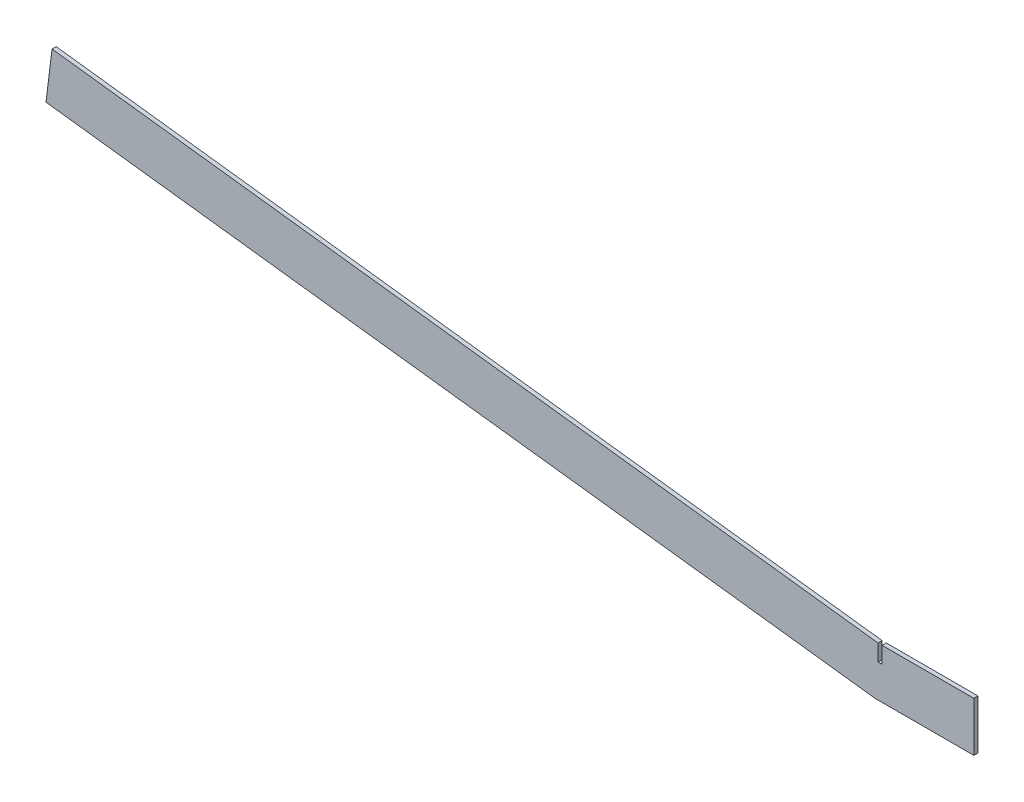
ISO-10303-21;
HEADER;
FILE_DESCRIPTION(('STEP AP214'),'2;1');
FILE_NAME('part.step','',(''),(''),'','','');
FILE_SCHEMA(('AUTOMOTIVE_DESIGN { 1 0 10303 214 1 1 1 1 }'));
ENDSEC;
DATA;
#1=APPLICATION_CONTEXT('core data for automotive mechanical design processes');
#2=APPLICATION_PROTOCOL_DEFINITION('international standard','automotive_design',2000,#1);
#3=PRODUCT_CONTEXT('',#1,'mechanical');
#4=PRODUCT('Part','Part','',(#3));
#5=PRODUCT_RELATED_PRODUCT_CATEGORY('part','',(#4));
#6=PRODUCT_DEFINITION_FORMATION('','',#4);
#7=PRODUCT_DEFINITION_CONTEXT('part definition',#1,'design');
#8=PRODUCT_DEFINITION('design','',#6,#7);
#9=PRODUCT_DEFINITION_SHAPE('','',#8);
#10=(LENGTH_UNIT() NAMED_UNIT(*) SI_UNIT(.MILLI.,.METRE.));
#11=(NAMED_UNIT(*) PLANE_ANGLE_UNIT() SI_UNIT($,.RADIAN.));
#12=(NAMED_UNIT(*) SI_UNIT($,.STERADIAN.) SOLID_ANGLE_UNIT());
#13=UNCERTAINTY_MEASURE_WITH_UNIT(LENGTH_MEASURE(1.E-05),#10,'distance_accuracy_value','');
#14=(GEOMETRIC_REPRESENTATION_CONTEXT(3) GLOBAL_UNCERTAINTY_ASSIGNED_CONTEXT((#13)) GLOBAL_UNIT_ASSIGNED_CONTEXT((#10,
#11,#12)) REPRESENTATION_CONTEXT('',''));
#15=CARTESIAN_POINT('',(0.,0.,0.));
#16=DIRECTION('',(0.,0.,1.));
#17=DIRECTION('',(1.,0.,0.));
#18=AXIS2_PLACEMENT_3D('',#15,#16,#17);
#19=CARTESIAN_POINT('',(5.50529582773423,0.,1.5875));
#20=DIRECTION('',(-1.,0.,0.));
#21=DIRECTION('',(0.,0.,1.));
#22=AXIS2_PLACEMENT_3D('',#19,#20,#21);
#23=PLANE('',#22);
#24=DIRECTION('',(0.,1.,0.));
#25=VECTOR('',#24,1.);
#26=CARTESIAN_POINT('',(5.50529582773423,0.,-1.5875));
#27=LINE('',#26,#25);
#28=CARTESIAN_POINT('',(5.50529582773423,25.4,-1.5875));
#29=VERTEX_POINT('',#28);
#30=CARTESIAN_POINT('',(5.50529582773423,38.1,-1.5875));
#31=VERTEX_POINT('',#30);
#32=EDGE_CURVE('E145',#29,#31,#27,.T.);
#33=ORIENTED_EDGE('',*,*,#32,.F.);
#34=DIRECTION('',(0.,0.,-1.));
#35=VECTOR('',#34,1.);
#36=CARTESIAN_POINT('',(5.50529582773423,25.4,1.5875));
#37=LINE('',#36,#35);
#38=CARTESIAN_POINT('',(5.50529582773423,25.4,1.5875));
#39=VERTEX_POINT('',#38);
#40=EDGE_CURVE('E11',#39,#29,#37,.T.);
#41=ORIENTED_EDGE('',*,*,#40,.F.);
#42=DIRECTION('',(0.,1.,0.));
#43=VECTOR('',#42,1.);
#44=CARTESIAN_POINT('',(5.50529582773423,0.,1.5875));
#45=LINE('',#44,#43);
#46=CARTESIAN_POINT('',(5.50529582773423,38.1,1.5875));
#47=VERTEX_POINT('',#46);
#48=EDGE_CURVE('E177',#39,#47,#45,.T.);
#49=ORIENTED_EDGE('',*,*,#48,.T.);
#50=DIRECTION('',(0.,0.,-1.));
#51=VECTOR('',#50,1.);
#52=CARTESIAN_POINT('',(5.50529582773423,38.1,1.5875));
#53=LINE('',#52,#51);
#54=EDGE_CURVE('E58',#47,#31,#53,.T.);
#55=ORIENTED_EDGE('',*,*,#54,.T.);
#56=EDGE_LOOP('',(#33,#41,#49,#55));
#57=FACE_BOUND('',#56,.T.);
#58=ADVANCED_FACE('F41',(#57),#23,.T.);
#59=CARTESIAN_POINT('',(0.,25.4,1.5875));
#60=DIRECTION('',(0.,1.,0.));
#61=DIRECTION('',(0.,0.,1.));
#62=AXIS2_PLACEMENT_3D('',#59,#60,#61);
#63=PLANE('',#62);
#64=DIRECTION('',(1.,0.,0.));
#65=VECTOR('',#64,1.);
#66=CARTESIAN_POINT('',(0.,25.4,-1.5875));
#67=LINE('',#66,#65);
#68=CARTESIAN_POINT('',(2.33029582773423,25.4,-1.5875));
#69=VERTEX_POINT('',#68);
#70=EDGE_CURVE('E148',#69,#29,#67,.T.);
#71=ORIENTED_EDGE('',*,*,#70,.F.);
#72=DIRECTION('',(0.,0.,-1.));
#73=VECTOR('',#72,1.);
#74=CARTESIAN_POINT('',(2.33029582773423,25.4,1.5875));
#75=LINE('',#74,#73);
#76=CARTESIAN_POINT('',(2.33029582773423,25.4,1.5875));
#77=VERTEX_POINT('',#76);
#78=EDGE_CURVE('E50',#77,#69,#75,.T.);
#79=ORIENTED_EDGE('',*,*,#78,.F.);
#80=DIRECTION('',(1.,0.,0.));
#81=VECTOR('',#80,1.);
#82=CARTESIAN_POINT('',(0.,25.4,1.5875));
#83=LINE('',#82,#81);
#84=EDGE_CURVE('E214',#77,#39,#83,.T.);
#85=ORIENTED_EDGE('',*,*,#84,.T.);
#86=ORIENTED_EDGE('',*,*,#40,.T.);
#87=EDGE_LOOP('',(#71,#79,#85,#86));
#88=FACE_BOUND('',#87,.T.);
#89=ADVANCED_FACE('F203',(#88),#63,.T.);
#90=CARTESIAN_POINT('',(2.33029582773423,0.,1.5875));
#91=DIRECTION('',(1.,0.,0.));
#92=DIRECTION('',(0.,1.,0.));
#93=AXIS2_PLACEMENT_3D('',#90,#91,#92);
#94=PLANE('',#93);
#95=DIRECTION('',(0.,-1.,0.));
#96=VECTOR('',#95,1.);
#97=CARTESIAN_POINT('',(2.33029582773423,0.,-1.5875));
#98=LINE('',#97,#96);
#99=CARTESIAN_POINT('',(2.33029582773423,38.1,-1.5875));
#100=VERTEX_POINT('',#99);
#101=EDGE_CURVE('E152',#100,#69,#98,.T.);
#102=ORIENTED_EDGE('',*,*,#101,.F.);
#103=DIRECTION('',(0.,0.,-1.));
#104=VECTOR('',#103,1.);
#105=CARTESIAN_POINT('',(2.33029582773423,38.1,1.5875));
#106=LINE('',#105,#104);
#107=CARTESIAN_POINT('',(2.33029582773423,38.1,1.5875));
#108=VERTEX_POINT('',#107);
#109=EDGE_CURVE('E190',#108,#100,#106,.T.);
#110=ORIENTED_EDGE('',*,*,#109,.F.);
#111=DIRECTION('',(0.,-1.,0.));
#112=VECTOR('',#111,1.);
#113=CARTESIAN_POINT('',(2.33029582773423,0.,1.5875));
#114=LINE('',#113,#112);
#115=EDGE_CURVE('E199',#108,#77,#114,.T.);
#116=ORIENTED_EDGE('',*,*,#115,.T.);
#117=ORIENTED_EDGE('',*,*,#78,.T.);
#118=EDGE_LOOP('',(#102,#110,#116,#117));
#119=FACE_BOUND('',#118,.T.);
#120=ADVANCED_FACE('F197',(#119),#94,.T.);
#121=CARTESIAN_POINT('',(4.64322198373613,37.8160083775344,1.5875));
#122=DIRECTION('',(0.121869343405148,0.992546151641322,0.));
#123=DIRECTION('',(-0.992546151641322,0.121869343405148,0.));
#124=AXIS2_PLACEMENT_3D('',#121,#122,#123);
#125=PLANE('',#124);
#126=DIRECTION('',(0.992546151641322,-0.121869343405148,0.));
#127=VECTOR('',#126,1.);
#128=CARTESIAN_POINT('',(4.64322198373613,37.8160083775344,-1.5875));
#129=LINE('',#128,#127);
#130=CARTESIAN_POINT('',(-633.837785038735,116.211618469633,-1.5875));
#131=VERTEX_POINT('',#130);
#132=EDGE_CURVE('E156',#131,#100,#129,.T.);
#133=ORIENTED_EDGE('',*,*,#132,.F.);
#134=DIRECTION('',(0.,0.,-1.));
#135=VECTOR('',#134,1.);
#136=CARTESIAN_POINT('',(-633.837785038735,116.211618469633,1.5875));
#137=LINE('',#136,#135);
#138=CARTESIAN_POINT('',(-633.837785038735,116.211618469633,1.5875));
#139=VERTEX_POINT('',#138);
#140=EDGE_CURVE('E187',#139,#131,#137,.T.);
#141=ORIENTED_EDGE('',*,*,#140,.F.);
#142=DIRECTION('',(0.992546151641322,-0.121869343405148,0.));
#143=VECTOR('',#142,1.);
#144=CARTESIAN_POINT('',(4.64322198373613,37.8160083775344,1.5875));
#145=LINE('',#144,#143);
#146=EDGE_CURVE('E212',#139,#108,#145,.T.);
#147=ORIENTED_EDGE('',*,*,#146,.T.);
#148=ORIENTED_EDGE('',*,*,#109,.T.);
#149=EDGE_LOOP('',(#133,#141,#147,#148));
#150=FACE_BOUND('',#149,.T.);
#151=ADVANCED_FACE('F209',(#150),#125,.T.);
#152=CARTESIAN_POINT('',(-638.481007022471,78.3956100920967,1.5875));
#153=DIRECTION('',(-0.992546151641322,0.121869343405145,0.));
#154=DIRECTION('',(-0.121869343405145,-0.992546151641322,0.));
#155=AXIS2_PLACEMENT_3D('',#152,#153,#154);
#156=PLANE('',#155);
#157=DIRECTION('',(0.121869343405145,0.992546151641323,0.));
#158=VECTOR('',#157,1.);
#159=CARTESIAN_POINT('',(-638.481007022471,78.3956100920967,-1.5875));
#160=LINE('',#159,#158);
#161=CARTESIAN_POINT('',(-638.481007022471,78.3956100920986,-1.5875));
#162=VERTEX_POINT('',#161);
#163=EDGE_CURVE('E160',#162,#131,#160,.T.);
#164=ORIENTED_EDGE('',*,*,#163,.F.);
#165=DIRECTION('',(0.,0.,-1.));
#166=VECTOR('',#165,1.);
#167=CARTESIAN_POINT('',(-638.481007022471,78.3956100920986,1.5875));
#168=LINE('',#167,#166);
#169=CARTESIAN_POINT('',(-638.481007022471,78.3956100920986,1.5875));
#170=VERTEX_POINT('',#169);
#171=EDGE_CURVE('E184',#170,#162,#168,.T.);
#172=ORIENTED_EDGE('',*,*,#171,.F.);
#173=DIRECTION('',(0.121869343405145,0.992546151641323,0.));
#174=VECTOR('',#173,1.);
#175=CARTESIAN_POINT('',(-638.481007022471,78.3956100920967,1.5875));
#176=LINE('',#175,#174);
#177=EDGE_CURVE('E219',#170,#139,#176,.T.);
#178=ORIENTED_EDGE('',*,*,#177,.T.);
#179=ORIENTED_EDGE('',*,*,#140,.T.);
#180=EDGE_LOOP('',(#164,#172,#178,#179));
#181=FACE_BOUND('',#180,.T.);
#182=ADVANCED_FACE('F250',(#181),#156,.T.);
#183=CARTESIAN_POINT('',(0.,0.,1.5875));
#184=DIRECTION('',(-0.121869343405148,-0.992546151641322,0.));
#185=DIRECTION('',(0.992546151641322,-0.121869343405148,0.));
#186=AXIS2_PLACEMENT_3D('',#183,#184,#185);
#187=PLANE('',#186);
#188=DIRECTION('',(-0.992546151641322,0.121869343405148,0.));
#189=VECTOR('',#188,1.);
#190=CARTESIAN_POINT('',(0.,0.,-1.5875));
#191=LINE('',#190,#189);
#192=CARTESIAN_POINT('',(0.,0.,-1.5875));
#193=VERTEX_POINT('',#192);
#194=EDGE_CURVE('E164',#193,#162,#191,.T.);
#195=ORIENTED_EDGE('',*,*,#194,.F.);
#196=DIRECTION('',(0.,0.,-1.));
#197=VECTOR('',#196,1.);
#198=CARTESIAN_POINT('',(0.,0.,1.5875));
#199=LINE('',#198,#197);
#200=CARTESIAN_POINT('',(0.,0.,1.5875));
#201=VERTEX_POINT('',#200);
#202=EDGE_CURVE('E124',#201,#193,#199,.T.);
#203=ORIENTED_EDGE('',*,*,#202,.F.);
#204=DIRECTION('',(-0.992546151641322,0.121869343405148,0.));
#205=VECTOR('',#204,1.);
#206=CARTESIAN_POINT('',(0.,0.,1.5875));
#207=LINE('',#206,#205);
#208=EDGE_CURVE('E134',#201,#170,#207,.T.);
#209=ORIENTED_EDGE('',*,*,#208,.T.);
#210=ORIENTED_EDGE('',*,*,#171,.T.);
#211=EDGE_LOOP('',(#195,#203,#209,#210));
#212=FACE_BOUND('',#211,.T.);
#213=ADVANCED_FACE('F228',(#212),#187,.T.);
#214=CARTESIAN_POINT('',(0.,0.,1.5875));
#215=DIRECTION('',(0.,-1.,0.));
#216=DIRECTION('',(1.,0.,0.));
#217=AXIS2_PLACEMENT_3D('',#214,#215,#216);
#218=PLANE('',#217);
#219=DIRECTION('',(-1.,0.,0.));
#220=VECTOR('',#219,1.);
#221=CARTESIAN_POINT('',(0.,0.,-1.5875));
#222=LINE('',#221,#220);
#223=CARTESIAN_POINT('',(76.2,0.,-1.5875));
#224=VERTEX_POINT('',#223);
#225=EDGE_CURVE('E119',#224,#193,#222,.T.);
#226=ORIENTED_EDGE('',*,*,#225,.F.);
#227=DIRECTION('',(0.,0.,-1.));
#228=VECTOR('',#227,1.);
#229=CARTESIAN_POINT('',(76.2,0.,1.5875));
#230=LINE('',#229,#228);
#231=CARTESIAN_POINT('',(76.2,0.,1.5875));
#232=VERTEX_POINT('',#231);
#233=EDGE_CURVE('E114',#232,#224,#230,.T.);
#234=ORIENTED_EDGE('',*,*,#233,.F.);
#235=DIRECTION('',(-1.,0.,0.));
#236=VECTOR('',#235,1.);
#237=CARTESIAN_POINT('',(0.,0.,1.5875));
#238=LINE('',#237,#236);
#239=EDGE_CURVE('E117',#232,#201,#238,.T.);
#240=ORIENTED_EDGE('',*,*,#239,.T.);
#241=ORIENTED_EDGE('',*,*,#202,.T.);
#242=EDGE_LOOP('',(#226,#234,#240,#241));
#243=FACE_BOUND('',#242,.T.);
#244=ADVANCED_FACE('F116',(#243),#218,.T.);
#245=CARTESIAN_POINT('',(76.2,-1.94289029309402E-13,1.5875));
#246=DIRECTION('',(1.,0.,0.));
#247=DIRECTION('',(0.,1.,0.));
#248=AXIS2_PLACEMENT_3D('',#245,#246,#247);
#249=PLANE('',#248);
#250=DIRECTION('',(0.,-1.,0.));
#251=VECTOR('',#250,1.);
#252=CARTESIAN_POINT('',(76.2,-1.94289029309402E-13,-1.5875));
#253=LINE('',#252,#251);
#254=CARTESIAN_POINT('',(76.2000000000001,38.1,-1.5875));
#255=VERTEX_POINT('',#254);
#256=EDGE_CURVE('E170',#255,#224,#253,.T.);
#257=ORIENTED_EDGE('',*,*,#256,.F.);
#258=DIRECTION('',(0.,0.,-1.));
#259=VECTOR('',#258,1.);
#260=CARTESIAN_POINT('',(76.2000000000001,38.1,1.5875));
#261=LINE('',#260,#259);
#262=CARTESIAN_POINT('',(76.2000000000001,38.1,1.5875));
#263=VERTEX_POINT('',#262);
#264=EDGE_CURVE('E86',#263,#255,#261,.T.);
#265=ORIENTED_EDGE('',*,*,#264,.F.);
#266=DIRECTION('',(0.,-1.,0.));
#267=VECTOR('',#266,1.);
#268=CARTESIAN_POINT('',(76.2,-1.94289029309402E-13,1.5875));
#269=LINE('',#268,#267);
#270=EDGE_CURVE('E131',#263,#232,#269,.T.);
#271=ORIENTED_EDGE('',*,*,#270,.T.);
#272=ORIENTED_EDGE('',*,*,#233,.T.);
#273=EDGE_LOOP('',(#257,#265,#271,#272));
#274=FACE_BOUND('',#273,.T.);
#275=ADVANCED_FACE('F137',(#274),#249,.T.);
#276=CARTESIAN_POINT('',(0.,38.1,1.5875));
#277=DIRECTION('',(0.,1.,0.));
#278=DIRECTION('',(0.,0.,1.));
#279=AXIS2_PLACEMENT_3D('',#276,#277,#278);
#280=PLANE('',#279);
#281=DIRECTION('',(1.,0.,0.));
#282=VECTOR('',#281,1.);
#283=CARTESIAN_POINT('',(0.,38.1,-1.5875));
#284=LINE('',#283,#282);
#285=EDGE_CURVE('E173',#31,#255,#284,.T.);
#286=ORIENTED_EDGE('',*,*,#285,.F.);
#287=ORIENTED_EDGE('',*,*,#54,.F.);
#288=DIRECTION('',(1.,0.,0.));
#289=VECTOR('',#288,1.);
#290=CARTESIAN_POINT('',(0.,38.1,1.5875));
#291=LINE('',#290,#289);
#292=EDGE_CURVE('E139',#47,#263,#291,.T.);
#293=ORIENTED_EDGE('',*,*,#292,.T.);
#294=ORIENTED_EDGE('',*,*,#264,.T.);
#295=EDGE_LOOP('',(#286,#287,#293,#294));
#296=FACE_BOUND('',#295,.T.);
#297=ADVANCED_FACE('F229',(#296),#280,.T.);
#298=CARTESIAN_POINT('',(0.,0.,1.5875));
#299=DIRECTION('',(0.,0.,1.));
#300=DIRECTION('',(1.,0.,0.));
#301=AXIS2_PLACEMENT_3D('',#298,#299,#300);
#302=PLANE('',#301);
#303=ORIENTED_EDGE('',*,*,#48,.F.);
#304=ORIENTED_EDGE('',*,*,#84,.F.);
#305=ORIENTED_EDGE('',*,*,#115,.F.);
#306=ORIENTED_EDGE('',*,*,#146,.F.);
#307=ORIENTED_EDGE('',*,*,#177,.F.);
#308=ORIENTED_EDGE('',*,*,#208,.F.);
#309=ORIENTED_EDGE('',*,*,#239,.F.);
#310=ORIENTED_EDGE('',*,*,#270,.F.);
#311=ORIENTED_EDGE('',*,*,#292,.F.);
#312=EDGE_LOOP('',(#303,#304,#305,#306,#307,#308,#309,#310,#311));
#313=FACE_BOUND('',#312,.T.);
#314=ADVANCED_FACE('F129',(#313),#302,.T.);
#315=CARTESIAN_POINT('',(0.,0.,-1.5875));
#316=DIRECTION('',(0.,0.,1.));
#317=DIRECTION('',(1.,0.,0.));
#318=AXIS2_PLACEMENT_3D('',#315,#316,#317);
#319=PLANE('',#318);
#320=ORIENTED_EDGE('',*,*,#32,.T.);
#321=ORIENTED_EDGE('',*,*,#285,.T.);
#322=ORIENTED_EDGE('',*,*,#256,.T.);
#323=ORIENTED_EDGE('',*,*,#225,.T.);
#324=ORIENTED_EDGE('',*,*,#194,.T.);
#325=ORIENTED_EDGE('',*,*,#163,.T.);
#326=ORIENTED_EDGE('',*,*,#132,.T.);
#327=ORIENTED_EDGE('',*,*,#101,.T.);
#328=ORIENTED_EDGE('',*,*,#70,.T.);
#329=EDGE_LOOP('',(#320,#321,#322,#323,#324,#325,#326,#327,#328));
#330=FACE_BOUND('',#329,.T.);
#331=ADVANCED_FACE('F205',(#330),#319,.F.);
#332=CLOSED_SHELL('',(#58,#89,#120,#151,#182,#213,#244,#275,#297,#314,#331));
#333=MANIFOLD_SOLID_BREP('B2',#332);
#334=ADVANCED_BREP_SHAPE_REPRESENTATION('',(#18,#333),#14);
#335=SHAPE_DEFINITION_REPRESENTATION(#9,#334);
ENDSEC;
END-ISO-10303-21;
